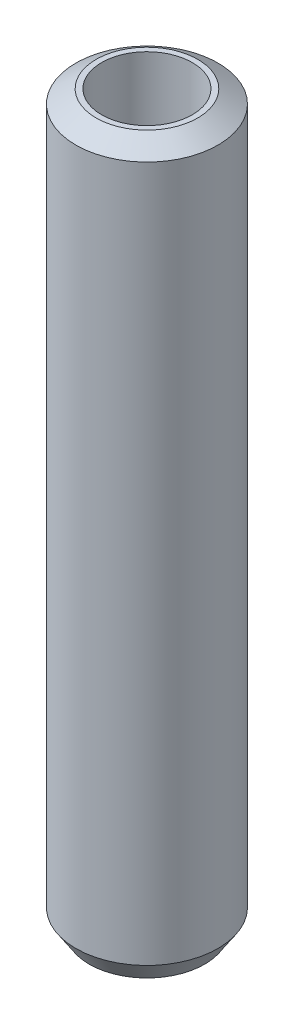
ISO-10303-21;
HEADER;
FILE_DESCRIPTION(('STEP AP214'),'2;1');
FILE_NAME('part.step','',(''),(''),'','','');
FILE_SCHEMA(('AUTOMOTIVE_DESIGN { 1 0 10303 214 1 1 1 1 }'));
ENDSEC;
DATA;
#1=APPLICATION_CONTEXT('core data for automotive mechanical design processes');
#2=APPLICATION_PROTOCOL_DEFINITION('international standard','automotive_design',2000,#1);
#3=PRODUCT_CONTEXT('',#1,'mechanical');
#4=PRODUCT('Part','Part','',(#3));
#5=PRODUCT_RELATED_PRODUCT_CATEGORY('part','',(#4));
#6=PRODUCT_DEFINITION_FORMATION('','',#4);
#7=PRODUCT_DEFINITION_CONTEXT('part definition',#1,'design');
#8=PRODUCT_DEFINITION('design','',#6,#7);
#9=PRODUCT_DEFINITION_SHAPE('','',#8);
#10=(LENGTH_UNIT() NAMED_UNIT(*) SI_UNIT(.MILLI.,.METRE.));
#11=(NAMED_UNIT(*) PLANE_ANGLE_UNIT() SI_UNIT($,.RADIAN.));
#12=(NAMED_UNIT(*) SI_UNIT($,.STERADIAN.) SOLID_ANGLE_UNIT());
#13=UNCERTAINTY_MEASURE_WITH_UNIT(LENGTH_MEASURE(1.E-05),#10,'distance_accuracy_value','');
#14=(GEOMETRIC_REPRESENTATION_CONTEXT(3) GLOBAL_UNCERTAINTY_ASSIGNED_CONTEXT((#13)) GLOBAL_UNIT_ASSIGNED_CONTEXT((#10,
#11,#12)) REPRESENTATION_CONTEXT('',''));
#15=CARTESIAN_POINT('',(0.,0.,0.));
#16=DIRECTION('',(0.,0.,1.));
#17=DIRECTION('',(1.,0.,0.));
#18=AXIS2_PLACEMENT_3D('',#15,#16,#17);
#19=CARTESIAN_POINT('',(0.,256.461505475964,0.));
#20=DIRECTION('',(0.,-1.,0.));
#21=DIRECTION('',(0.,0.,-1.));
#22=AXIS2_PLACEMENT_3D('',#19,#20,#21);
#23=CYLINDRICAL_SURFACE('',#22,25.);
#24=CARTESIAN_POINT('',(0.,251.777229587188,0.));
#25=DIRECTION('',(0.,1.,0.));
#26=DIRECTION('',(0.,0.,1.));
#27=AXIS2_PLACEMENT_3D('',#24,#25,#26);
#28=CIRCLE('',#27,25.);
#29=CARTESIAN_POINT('',(0.,251.777229587188,25.));
#30=VERTEX_POINT('',#29);
#31=EDGE_CURVE('E50',#30,#30,#28,.F.);
#32=ORIENTED_EDGE('',*,*,#31,.T.);
#33=EDGE_LOOP('',(#32));
#34=FACE_BOUND('',#33,.T.);
#35=CARTESIAN_POINT('',(0.,7.13538122508281,0.));
#36=DIRECTION('',(0.,1.,0.));
#37=DIRECTION('',(0.,0.,1.));
#38=AXIS2_PLACEMENT_3D('',#35,#36,#37);
#39=CIRCLE('',#38,25.);
#40=CARTESIAN_POINT('',(0.,7.13538122508281,25.));
#41=VERTEX_POINT('',#40);
#42=EDGE_CURVE('E51',#41,#41,#39,.T.);
#43=ORIENTED_EDGE('',*,*,#42,.T.);
#44=EDGE_LOOP('',(#43));
#45=FACE_BOUND('',#44,.T.);
#46=ADVANCED_FACE('F39',(#34,#45),#23,.T.);
#47=CARTESIAN_POINT('',(0.,256.461505475964,0.));
#48=DIRECTION('',(0.,1.,0.));
#49=DIRECTION('',(0.,0.,1.));
#50=AXIS2_PLACEMENT_3D('',#47,#48,#49);
#51=PLANE('',#50);
#52=CARTESIAN_POINT('',(0.,256.461505475964,0.));
#53=DIRECTION('',(0.,1.,0.));
#54=DIRECTION('',(0.,0.,1.));
#55=AXIS2_PLACEMENT_3D('',#52,#53,#54);
#56=CIRCLE('',#55,17.8646187749173);
#57=CARTESIAN_POINT('',(0.,256.461505475964,17.8646187749173));
#58=VERTEX_POINT('',#57);
#59=EDGE_CURVE('E54',#58,#58,#56,.T.);
#60=ORIENTED_EDGE('',*,*,#59,.T.);
#61=EDGE_LOOP('',(#60));
#62=FACE_BOUND('',#61,.T.);
#63=CARTESIAN_POINT('',(0.,256.461505475964,0.));
#64=DIRECTION('',(0.,1.,0.));
#65=DIRECTION('',(0.,0.,1.));
#66=AXIS2_PLACEMENT_3D('',#63,#64,#65);
#67=CIRCLE('',#66,15.9299372856441);
#68=CARTESIAN_POINT('',(0.,256.461505475964,15.9299372856441));
#69=VERTEX_POINT('',#68);
#70=EDGE_CURVE('E58',#69,#69,#67,.T.);
#71=ORIENTED_EDGE('',*,*,#70,.F.);
#72=EDGE_LOOP('',(#71));
#73=FACE_BOUND('',#72,.T.);
#74=ADVANCED_FACE('F69',(#62,#73),#51,.T.);
#75=CARTESIAN_POINT('',(0.,0.,0.));
#76=DIRECTION('',(0.,1.,0.));
#77=DIRECTION('',(0.,0.,1.));
#78=AXIS2_PLACEMENT_3D('',#75,#76,#77);
#79=PLANE('',#78);
#80=CARTESIAN_POINT('',(0.,0.,0.));
#81=DIRECTION('',(0.,1.,0.));
#82=DIRECTION('',(0.,0.,1.));
#83=AXIS2_PLACEMENT_3D('',#80,#81,#82);
#84=CIRCLE('',#83,20.315724111224);
#85=CARTESIAN_POINT('',(0.,0.,20.315724111224));
#86=VERTEX_POINT('',#85);
#87=EDGE_CURVE('E10',#86,#86,#84,.F.);
#88=ORIENTED_EDGE('',*,*,#87,.T.);
#89=EDGE_LOOP('',(#88));
#90=FACE_BOUND('',#89,.T.);
#91=CARTESIAN_POINT('',(0.,0.,0.));
#92=DIRECTION('',(0.,1.,0.));
#93=DIRECTION('',(0.,0.,1.));
#94=AXIS2_PLACEMENT_3D('',#91,#92,#93);
#95=CIRCLE('',#94,15.9299372856441);
#96=CARTESIAN_POINT('',(0.,0.,15.9299372856441));
#97=VERTEX_POINT('',#96);
#98=EDGE_CURVE('E63',#97,#97,#95,.T.);
#99=ORIENTED_EDGE('',*,*,#98,.T.);
#100=EDGE_LOOP('',(#99));
#101=FACE_BOUND('',#100,.T.);
#102=ADVANCED_FACE('F75',(#90,#101),#79,.F.);
#103=CARTESIAN_POINT('',(0.,256.461505475964,0.));
#104=DIRECTION('',(0.,-1.,0.));
#105=DIRECTION('',(0.,0.,-1.));
#106=AXIS2_PLACEMENT_3D('',#103,#104,#105);
#107=CYLINDRICAL_SURFACE('',#106,15.9299372856441);
#108=ORIENTED_EDGE('',*,*,#70,.T.);
#109=EDGE_LOOP('',(#108));
#110=FACE_BOUND('',#109,.T.);
#111=ORIENTED_EDGE('',*,*,#98,.F.);
#112=EDGE_LOOP('',(#111));
#113=FACE_BOUND('',#112,.T.);
#114=ADVANCED_FACE('F70',(#110,#113),#107,.F.);
#115=CARTESIAN_POINT('',(0.,256.461505475964,0.));
#116=DIRECTION('',(0.,-1.,0.));
#117=DIRECTION('',(0.,0.,-1.));
#118=AXIS2_PLACEMENT_3D('',#115,#116,#117);
#119=CONICAL_SURFACE('',#118,17.8646187749173,0.98987522763405);
#120=ORIENTED_EDGE('',*,*,#31,.F.);
#121=EDGE_LOOP('',(#120));
#122=FACE_BOUND('',#121,.T.);
#123=ORIENTED_EDGE('',*,*,#59,.F.);
#124=EDGE_LOOP('',(#123));
#125=FACE_BOUND('',#124,.T.);
#126=ADVANCED_FACE('F81',(#122,#125),#119,.T.);
#127=CARTESIAN_POINT('',(0.,7.13538122508281,0.));
#128=DIRECTION('',(0.,1.,0.));
#129=DIRECTION('',(0.,0.,1.));
#130=AXIS2_PLACEMENT_3D('',#127,#128,#129);
#131=CONICAL_SURFACE('',#130,25.,0.580921099160847);
#132=ORIENTED_EDGE('',*,*,#87,.F.);
#133=EDGE_LOOP('',(#132));
#134=FACE_BOUND('',#133,.T.);
#135=ORIENTED_EDGE('',*,*,#42,.F.);
#136=EDGE_LOOP('',(#135));
#137=FACE_BOUND('',#136,.T.);
#138=ADVANCED_FACE('F45',(#134,#137),#131,.T.);
#139=CLOSED_SHELL('',(#46,#74,#102,#114,#126,#138));
#140=MANIFOLD_SOLID_BREP('B2',#139);
#141=ADVANCED_BREP_SHAPE_REPRESENTATION('',(#18,#140),#14);
#142=SHAPE_DEFINITION_REPRESENTATION(#9,#141);
ENDSEC;
END-ISO-10303-21;
